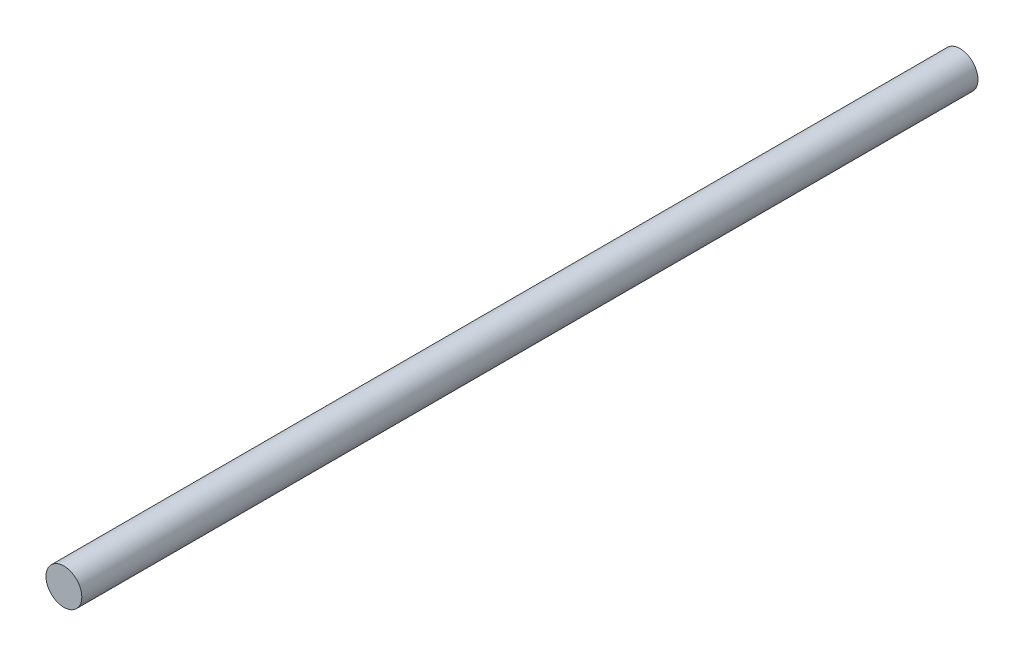
ISO-10303-21;
HEADER;
FILE_DESCRIPTION(('STEP AP214'),'2;1');
FILE_NAME('part.step','',(''),(''),'','','');
FILE_SCHEMA(('AUTOMOTIVE_DESIGN { 1 0 10303 214 1 1 1 1 }'));
ENDSEC;
DATA;
#1=APPLICATION_CONTEXT('core data for automotive mechanical design processes');
#2=APPLICATION_PROTOCOL_DEFINITION('international standard','automotive_design',2000,#1);
#3=PRODUCT_CONTEXT('',#1,'mechanical');
#4=PRODUCT('Part','Part','',(#3));
#5=PRODUCT_RELATED_PRODUCT_CATEGORY('part','',(#4));
#6=PRODUCT_DEFINITION_FORMATION('','',#4);
#7=PRODUCT_DEFINITION_CONTEXT('part definition',#1,'design');
#8=PRODUCT_DEFINITION('design','',#6,#7);
#9=PRODUCT_DEFINITION_SHAPE('','',#8);
#10=(LENGTH_UNIT() NAMED_UNIT(*) SI_UNIT(.MILLI.,.METRE.));
#11=(NAMED_UNIT(*) PLANE_ANGLE_UNIT() SI_UNIT($,.RADIAN.));
#12=(NAMED_UNIT(*) SI_UNIT($,.STERADIAN.) SOLID_ANGLE_UNIT());
#13=UNCERTAINTY_MEASURE_WITH_UNIT(LENGTH_MEASURE(1.E-05),#10,'distance_accuracy_value','');
#14=(GEOMETRIC_REPRESENTATION_CONTEXT(3) GLOBAL_UNCERTAINTY_ASSIGNED_CONTEXT((#13)) GLOBAL_UNIT_ASSIGNED_CONTEXT((#10,
#11,#12)) REPRESENTATION_CONTEXT('',''));
#15=CARTESIAN_POINT('',(0.,0.,0.));
#16=DIRECTION('',(0.,0.,1.));
#17=DIRECTION('',(1.,0.,0.));
#18=AXIS2_PLACEMENT_3D('',#15,#16,#17);
#19=CARTESIAN_POINT('',(0.,0.,250.));
#20=DIRECTION('',(0.,0.,-1.));
#21=DIRECTION('',(-1.,0.,0.));
#22=AXIS2_PLACEMENT_3D('',#19,#20,#21);
#23=CYLINDRICAL_SURFACE('',#22,10.);
#24=CARTESIAN_POINT('',(0.,0.,250.));
#25=DIRECTION('',(0.,0.,1.));
#26=DIRECTION('',(1.,0.,0.));
#27=AXIS2_PLACEMENT_3D('',#24,#25,#26);
#28=CIRCLE('',#27,10.);
#29=CARTESIAN_POINT('',(10.,0.,250.));
#30=VERTEX_POINT('',#29);
#31=EDGE_CURVE('E10',#30,#30,#28,.T.);
#32=ORIENTED_EDGE('',*,*,#31,.F.);
#33=EDGE_LOOP('',(#32));
#34=FACE_BOUND('',#33,.T.);
#35=CARTESIAN_POINT('',(0.,0.,-250.));
#36=DIRECTION('',(0.,0.,1.));
#37=DIRECTION('',(1.,0.,0.));
#38=AXIS2_PLACEMENT_3D('',#35,#36,#37);
#39=CIRCLE('',#38,10.);
#40=CARTESIAN_POINT('',(10.,0.,-250.));
#41=VERTEX_POINT('',#40);
#42=EDGE_CURVE('E37',#41,#41,#39,.T.);
#43=ORIENTED_EDGE('',*,*,#42,.T.);
#44=EDGE_LOOP('',(#43));
#45=FACE_BOUND('',#44,.T.);
#46=ADVANCED_FACE('F34',(#34,#45),#23,.T.);
#47=CARTESIAN_POINT('',(0.,0.,250.));
#48=DIRECTION('',(0.,0.,1.));
#49=DIRECTION('',(1.,0.,0.));
#50=AXIS2_PLACEMENT_3D('',#47,#48,#49);
#51=PLANE('',#50);
#52=ORIENTED_EDGE('',*,*,#31,.T.);
#53=EDGE_LOOP('',(#52));
#54=FACE_BOUND('',#53,.T.);
#55=ADVANCED_FACE('F49',(#54),#51,.T.);
#56=CARTESIAN_POINT('',(0.,0.,-250.));
#57=DIRECTION('',(0.,0.,1.));
#58=DIRECTION('',(1.,0.,0.));
#59=AXIS2_PLACEMENT_3D('',#56,#57,#58);
#60=PLANE('',#59);
#61=ORIENTED_EDGE('',*,*,#42,.F.);
#62=EDGE_LOOP('',(#61));
#63=FACE_BOUND('',#62,.T.);
#64=ADVANCED_FACE('F47',(#63),#60,.F.);
#65=CLOSED_SHELL('',(#46,#55,#64));
#66=MANIFOLD_SOLID_BREP('B2',#65);
#67=ADVANCED_BREP_SHAPE_REPRESENTATION('',(#18,#66),#14);
#68=SHAPE_DEFINITION_REPRESENTATION(#9,#67);
ENDSEC;
END-ISO-10303-21;
